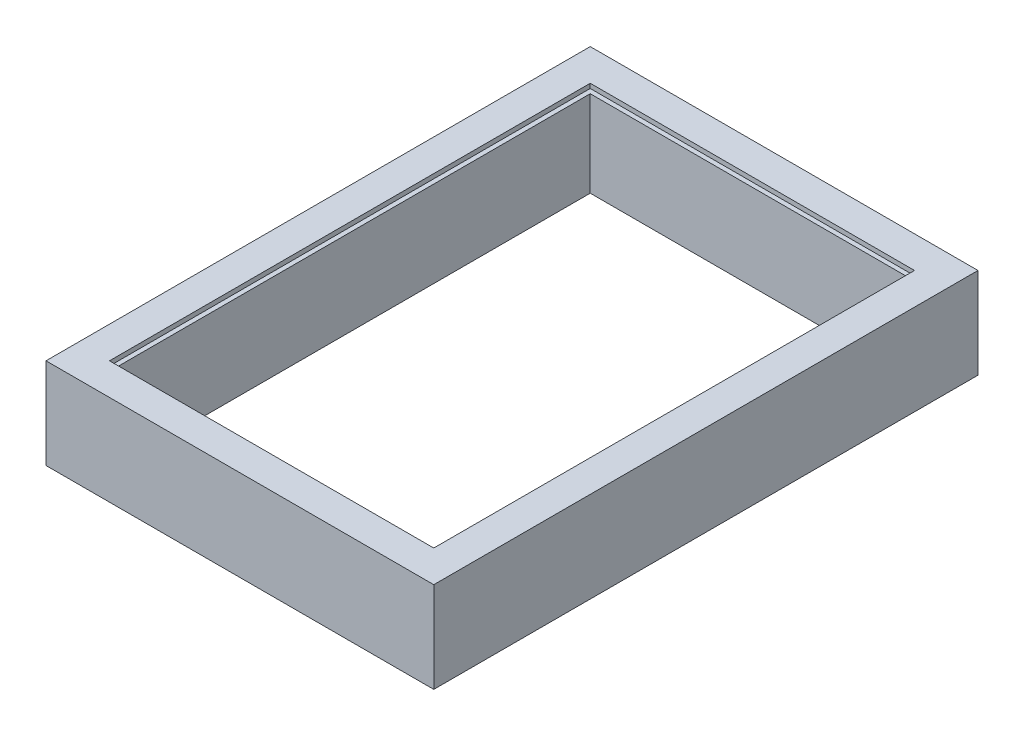
ISO-10303-21;
HEADER;
FILE_DESCRIPTION(('STEP AP214'),'2;1');
FILE_NAME('part.step','',(''),(''),'','','');
FILE_SCHEMA(('AUTOMOTIVE_DESIGN { 1 0 10303 214 1 1 1 1 }'));
ENDSEC;
DATA;
#1=APPLICATION_CONTEXT('core data for automotive mechanical design processes');
#2=APPLICATION_PROTOCOL_DEFINITION('international standard','automotive_design',2000,#1);
#3=PRODUCT_CONTEXT('',#1,'mechanical');
#4=PRODUCT('Part','Part','',(#3));
#5=PRODUCT_RELATED_PRODUCT_CATEGORY('part','',(#4));
#6=PRODUCT_DEFINITION_FORMATION('','',#4);
#7=PRODUCT_DEFINITION_CONTEXT('part definition',#1,'design');
#8=PRODUCT_DEFINITION('design','',#6,#7);
#9=PRODUCT_DEFINITION_SHAPE('','',#8);
#10=(LENGTH_UNIT() NAMED_UNIT(*) SI_UNIT(.MILLI.,.METRE.));
#11=(NAMED_UNIT(*) PLANE_ANGLE_UNIT() SI_UNIT($,.RADIAN.));
#12=(NAMED_UNIT(*) SI_UNIT($,.STERADIAN.) SOLID_ANGLE_UNIT());
#13=UNCERTAINTY_MEASURE_WITH_UNIT(LENGTH_MEASURE(1.E-05),#10,'distance_accuracy_value','');
#14=(GEOMETRIC_REPRESENTATION_CONTEXT(3) GLOBAL_UNCERTAINTY_ASSIGNED_CONTEXT((#13)) GLOBAL_UNIT_ASSIGNED_CONTEXT((#10,
#11,#12)) REPRESENTATION_CONTEXT('',''));
#15=CARTESIAN_POINT('',(0.,0.,0.));
#16=DIRECTION('',(0.,0.,1.));
#17=DIRECTION('',(1.,0.,0.));
#18=AXIS2_PLACEMENT_3D('',#15,#16,#17);
#19=CARTESIAN_POINT('',(347.5,200.,-520.));
#20=DIRECTION('',(-1.,0.,0.));
#21=DIRECTION('',(0.,0.,1.));
#22=AXIS2_PLACEMENT_3D('',#19,#20,#21);
#23=PLANE('',#22);
#24=DIRECTION('',(0.,-1.,0.));
#25=VECTOR('',#24,1.);
#26=CARTESIAN_POINT('',(347.5,200.,520.));
#27=LINE('',#26,#25);
#28=CARTESIAN_POINT('',(347.5,190.,520.));
#29=VERTEX_POINT('',#28);
#30=CARTESIAN_POINT('',(347.5,0.,520.));
#31=VERTEX_POINT('',#30);
#32=EDGE_CURVE('E208',#29,#31,#27,.T.);
#33=ORIENTED_EDGE('',*,*,#32,.F.);
#34=DIRECTION('',(0.,0.,-1.));
#35=VECTOR('',#34,1.);
#36=CARTESIAN_POINT('',(347.5,190.,-520.));
#37=LINE('',#36,#35);
#38=CARTESIAN_POINT('',(347.5,190.,-520.));
#39=VERTEX_POINT('',#38);
#40=EDGE_CURVE('E86',#29,#39,#37,.T.);
#41=ORIENTED_EDGE('',*,*,#40,.T.);
#42=DIRECTION('',(0.,-1.,0.));
#43=VECTOR('',#42,1.);
#44=CARTESIAN_POINT('',(347.5,200.,-520.));
#45=LINE('',#44,#43);
#46=CARTESIAN_POINT('',(347.5,0.,-520.));
#47=VERTEX_POINT('',#46);
#48=EDGE_CURVE('E214',#39,#47,#45,.T.);
#49=ORIENTED_EDGE('',*,*,#48,.T.);
#50=DIRECTION('',(0.,0.,-1.));
#51=VECTOR('',#50,1.);
#52=CARTESIAN_POINT('',(347.5,0.,-520.));
#53=LINE('',#52,#51);
#54=EDGE_CURVE('E196',#31,#47,#53,.T.);
#55=ORIENTED_EDGE('',*,*,#54,.F.);
#56=EDGE_LOOP('',(#33,#41,#49,#55));
#57=FACE_BOUND('',#56,.T.);
#58=ADVANCED_FACE('F63',(#57),#23,.T.);
#59=CARTESIAN_POINT('',(-347.5,200.,-520.));
#60=DIRECTION('',(0.,0.,1.));
#61=DIRECTION('',(1.,0.,0.));
#62=AXIS2_PLACEMENT_3D('',#59,#60,#61);
#63=PLANE('',#62);
#64=ORIENTED_EDGE('',*,*,#48,.F.);
#65=DIRECTION('',(-1.,0.,0.));
#66=VECTOR('',#65,1.);
#67=CARTESIAN_POINT('',(-347.5,190.,-520.));
#68=LINE('',#67,#66);
#69=CARTESIAN_POINT('',(-347.5,190.,-520.));
#70=VERTEX_POINT('',#69);
#71=EDGE_CURVE('E192',#39,#70,#68,.T.);
#72=ORIENTED_EDGE('',*,*,#71,.T.);
#73=DIRECTION('',(0.,-1.,0.));
#74=VECTOR('',#73,1.);
#75=CARTESIAN_POINT('',(-347.5,200.,-520.));
#76=LINE('',#75,#74);
#77=CARTESIAN_POINT('',(-347.5,0.,-520.));
#78=VERTEX_POINT('',#77);
#79=EDGE_CURVE('E212',#70,#78,#76,.T.);
#80=ORIENTED_EDGE('',*,*,#79,.T.);
#81=DIRECTION('',(-1.,0.,0.));
#82=VECTOR('',#81,1.);
#83=CARTESIAN_POINT('',(-347.5,0.,-520.));
#84=LINE('',#83,#82);
#85=EDGE_CURVE('E199',#47,#78,#84,.T.);
#86=ORIENTED_EDGE('',*,*,#85,.F.);
#87=EDGE_LOOP('',(#64,#72,#80,#86));
#88=FACE_BOUND('',#87,.T.);
#89=ADVANCED_FACE('F279',(#88),#63,.T.);
#90=CARTESIAN_POINT('',(-347.5,200.,-520.));
#91=DIRECTION('',(1.,0.,0.));
#92=DIRECTION('',(0.,0.,-1.));
#93=AXIS2_PLACEMENT_3D('',#90,#91,#92);
#94=PLANE('',#93);
#95=ORIENTED_EDGE('',*,*,#79,.F.);
#96=DIRECTION('',(0.,0.,1.));
#97=VECTOR('',#96,1.);
#98=CARTESIAN_POINT('',(-347.5,190.,-520.));
#99=LINE('',#98,#97);
#100=CARTESIAN_POINT('',(-347.5,190.,520.));
#101=VERTEX_POINT('',#100);
#102=EDGE_CURVE('E186',#70,#101,#99,.T.);
#103=ORIENTED_EDGE('',*,*,#102,.T.);
#104=DIRECTION('',(0.,-1.,0.));
#105=VECTOR('',#104,1.);
#106=CARTESIAN_POINT('',(-347.5,200.,520.));
#107=LINE('',#106,#105);
#108=CARTESIAN_POINT('',(-347.5,0.,520.));
#109=VERTEX_POINT('',#108);
#110=EDGE_CURVE('E210',#101,#109,#107,.T.);
#111=ORIENTED_EDGE('',*,*,#110,.T.);
#112=DIRECTION('',(0.,0.,1.));
#113=VECTOR('',#112,1.);
#114=CARTESIAN_POINT('',(-347.5,0.,-520.));
#115=LINE('',#114,#113);
#116=EDGE_CURVE('E202',#78,#109,#115,.T.);
#117=ORIENTED_EDGE('',*,*,#116,.F.);
#118=EDGE_LOOP('',(#95,#103,#111,#117));
#119=FACE_BOUND('',#118,.T.);
#120=ADVANCED_FACE('F274',(#119),#94,.T.);
#121=CARTESIAN_POINT('',(-347.5,200.,520.));
#122=DIRECTION('',(0.,0.,-1.));
#123=DIRECTION('',(-1.,0.,0.));
#124=AXIS2_PLACEMENT_3D('',#121,#122,#123);
#125=PLANE('',#124);
#126=ORIENTED_EDGE('',*,*,#110,.F.);
#127=DIRECTION('',(1.,0.,0.));
#128=VECTOR('',#127,1.);
#129=CARTESIAN_POINT('',(-347.5,190.,520.));
#130=LINE('',#129,#128);
#131=EDGE_CURVE('E12',#101,#29,#130,.T.);
#132=ORIENTED_EDGE('',*,*,#131,.T.);
#133=ORIENTED_EDGE('',*,*,#32,.T.);
#134=DIRECTION('',(1.,0.,0.));
#135=VECTOR('',#134,1.);
#136=CARTESIAN_POINT('',(-347.5,0.,520.));
#137=LINE('',#136,#135);
#138=EDGE_CURVE('E205',#109,#31,#137,.T.);
#139=ORIENTED_EDGE('',*,*,#138,.F.);
#140=EDGE_LOOP('',(#126,#132,#133,#139));
#141=FACE_BOUND('',#140,.T.);
#142=ADVANCED_FACE('F266',(#141),#125,.T.);
#143=CARTESIAN_POINT('',(0.,200.,0.));
#144=DIRECTION('',(0.,1.,0.));
#145=DIRECTION('',(0.,0.,1.));
#146=AXIS2_PLACEMENT_3D('',#143,#144,#145);
#147=PLANE('',#146);
#148=DIRECTION('',(0.,0.,1.));
#149=VECTOR('',#148,1.);
#150=CARTESIAN_POINT('',(-357.5,200.,-530.));
#151=LINE('',#150,#149);
#152=CARTESIAN_POINT('',(-357.5,200.,-530.));
#153=VERTEX_POINT('',#152);
#154=CARTESIAN_POINT('',(-357.5,200.,530.));
#155=VERTEX_POINT('',#154);
#156=EDGE_CURVE('E78',#153,#155,#151,.T.);
#157=ORIENTED_EDGE('',*,*,#156,.F.);
#158=DIRECTION('',(-1.,0.,0.));
#159=VECTOR('',#158,1.);
#160=CARTESIAN_POINT('',(-357.5,200.,-530.));
#161=LINE('',#160,#159);
#162=CARTESIAN_POINT('',(357.5,200.,-530.));
#163=VERTEX_POINT('',#162);
#164=EDGE_CURVE('E171',#163,#153,#161,.T.);
#165=ORIENTED_EDGE('',*,*,#164,.F.);
#166=DIRECTION('',(0.,0.,-1.));
#167=VECTOR('',#166,1.);
#168=CARTESIAN_POINT('',(357.5,200.,-530.));
#169=LINE('',#168,#167);
#170=CARTESIAN_POINT('',(357.5,200.,530.));
#171=VERTEX_POINT('',#170);
#172=EDGE_CURVE('E174',#171,#163,#169,.T.);
#173=ORIENTED_EDGE('',*,*,#172,.F.);
#174=DIRECTION('',(1.,0.,0.));
#175=VECTOR('',#174,1.);
#176=CARTESIAN_POINT('',(-357.5,200.,530.));
#177=LINE('',#176,#175);
#178=EDGE_CURVE('E180',#155,#171,#177,.T.);
#179=ORIENTED_EDGE('',*,*,#178,.F.);
#180=EDGE_LOOP('',(#157,#165,#173,#179));
#181=FACE_BOUND('',#180,.T.);
#182=DIRECTION('',(0.,0.,-1.));
#183=VECTOR('',#182,1.);
#184=CARTESIAN_POINT('',(427.5,200.,-520.));
#185=LINE('',#184,#183);
#186=CARTESIAN_POINT('',(427.5,200.,600.));
#187=VERTEX_POINT('',#186);
#188=CARTESIAN_POINT('',(427.5,200.,-600.));
#189=VERTEX_POINT('',#188);
#190=EDGE_CURVE('E217',#187,#189,#185,.T.);
#191=ORIENTED_EDGE('',*,*,#190,.T.);
#192=DIRECTION('',(-1.,0.,0.));
#193=VECTOR('',#192,1.);
#194=CARTESIAN_POINT('',(-347.5,200.,-600.));
#195=LINE('',#194,#193);
#196=CARTESIAN_POINT('',(-427.5,200.,-600.));
#197=VERTEX_POINT('',#196);
#198=EDGE_CURVE('E220',#189,#197,#195,.T.);
#199=ORIENTED_EDGE('',*,*,#198,.T.);
#200=DIRECTION('',(0.,0.,1.));
#201=VECTOR('',#200,1.);
#202=CARTESIAN_POINT('',(-427.5,200.,-520.));
#203=LINE('',#202,#201);
#204=CARTESIAN_POINT('',(-427.5,200.,600.));
#205=VERTEX_POINT('',#204);
#206=EDGE_CURVE('E223',#197,#205,#203,.T.);
#207=ORIENTED_EDGE('',*,*,#206,.T.);
#208=DIRECTION('',(1.,0.,0.));
#209=VECTOR('',#208,1.);
#210=CARTESIAN_POINT('',(-347.5,200.,600.));
#211=LINE('',#210,#209);
#212=EDGE_CURVE('E225',#205,#187,#211,.T.);
#213=ORIENTED_EDGE('',*,*,#212,.T.);
#214=EDGE_LOOP('',(#191,#199,#207,#213));
#215=FACE_BOUND('',#214,.T.);
#216=ADVANCED_FACE('F264',(#181,#215),#147,.T.);
#217=CARTESIAN_POINT('',(0.,0.,0.));
#218=DIRECTION('',(0.,1.,0.));
#219=DIRECTION('',(0.,0.,1.));
#220=AXIS2_PLACEMENT_3D('',#217,#218,#219);
#221=PLANE('',#220);
#222=DIRECTION('',(0.,0.,-1.));
#223=VECTOR('',#222,1.);
#224=CARTESIAN_POINT('',(427.5,0.,-520.));
#225=LINE('',#224,#223);
#226=CARTESIAN_POINT('',(427.5,0.,600.));
#227=VERTEX_POINT('',#226);
#228=CARTESIAN_POINT('',(427.5,0.,-600.));
#229=VERTEX_POINT('',#228);
#230=EDGE_CURVE('E216',#227,#229,#225,.T.);
#231=ORIENTED_EDGE('',*,*,#230,.F.);
#232=DIRECTION('',(1.,0.,0.));
#233=VECTOR('',#232,1.);
#234=CARTESIAN_POINT('',(-347.5,0.,600.));
#235=LINE('',#234,#233);
#236=CARTESIAN_POINT('',(-427.5,0.,600.));
#237=VERTEX_POINT('',#236);
#238=EDGE_CURVE('E221',#237,#227,#235,.T.);
#239=ORIENTED_EDGE('',*,*,#238,.F.);
#240=DIRECTION('',(0.,0.,1.));
#241=VECTOR('',#240,1.);
#242=CARTESIAN_POINT('',(-427.5,0.,-520.));
#243=LINE('',#242,#241);
#244=CARTESIAN_POINT('',(-427.5,0.,-600.));
#245=VERTEX_POINT('',#244);
#246=EDGE_CURVE('E232',#245,#237,#243,.T.);
#247=ORIENTED_EDGE('',*,*,#246,.F.);
#248=DIRECTION('',(-1.,0.,0.));
#249=VECTOR('',#248,1.);
#250=CARTESIAN_POINT('',(-347.5,0.,-600.));
#251=LINE('',#250,#249);
#252=EDGE_CURVE('E230',#229,#245,#251,.T.);
#253=ORIENTED_EDGE('',*,*,#252,.F.);
#254=EDGE_LOOP('',(#231,#239,#247,#253));
#255=FACE_BOUND('',#254,.T.);
#256=ORIENTED_EDGE('',*,*,#54,.T.);
#257=ORIENTED_EDGE('',*,*,#85,.T.);
#258=ORIENTED_EDGE('',*,*,#116,.T.);
#259=ORIENTED_EDGE('',*,*,#138,.T.);
#260=EDGE_LOOP('',(#256,#257,#258,#259));
#261=FACE_BOUND('',#260,.T.);
#262=ADVANCED_FACE('F253',(#255,#261),#221,.F.);
#263=CARTESIAN_POINT('',(427.5,200.,-520.));
#264=DIRECTION('',(-1.,0.,0.));
#265=DIRECTION('',(0.,0.,1.));
#266=AXIS2_PLACEMENT_3D('',#263,#264,#265);
#267=PLANE('',#266);
#268=ORIENTED_EDGE('',*,*,#230,.T.);
#269=DIRECTION('',(0.,-1.,0.));
#270=VECTOR('',#269,1.);
#271=CARTESIAN_POINT('',(427.5,200.,-600.));
#272=LINE('',#271,#270);
#273=EDGE_CURVE('E71',#189,#229,#272,.T.);
#274=ORIENTED_EDGE('',*,*,#273,.F.);
#275=ORIENTED_EDGE('',*,*,#190,.F.);
#276=DIRECTION('',(0.,-1.,0.));
#277=VECTOR('',#276,1.);
#278=CARTESIAN_POINT('',(427.5,200.,600.));
#279=LINE('',#278,#277);
#280=EDGE_CURVE('E227',#187,#227,#279,.T.);
#281=ORIENTED_EDGE('',*,*,#280,.T.);
#282=EDGE_LOOP('',(#268,#274,#275,#281));
#283=FACE_BOUND('',#282,.T.);
#284=ADVANCED_FACE('F65',(#283),#267,.F.);
#285=CARTESIAN_POINT('',(-347.5,200.,-600.));
#286=DIRECTION('',(0.,0.,1.));
#287=DIRECTION('',(1.,0.,0.));
#288=AXIS2_PLACEMENT_3D('',#285,#286,#287);
#289=PLANE('',#288);
#290=ORIENTED_EDGE('',*,*,#252,.T.);
#291=DIRECTION('',(0.,-1.,0.));
#292=VECTOR('',#291,1.);
#293=CARTESIAN_POINT('',(-427.5,200.,-600.));
#294=LINE('',#293,#292);
#295=EDGE_CURVE('E240',#197,#245,#294,.T.);
#296=ORIENTED_EDGE('',*,*,#295,.F.);
#297=ORIENTED_EDGE('',*,*,#198,.F.);
#298=ORIENTED_EDGE('',*,*,#273,.T.);
#299=EDGE_LOOP('',(#290,#296,#297,#298));
#300=FACE_BOUND('',#299,.T.);
#301=ADVANCED_FACE('F245',(#300),#289,.F.);
#302=CARTESIAN_POINT('',(-427.5,200.,-520.));
#303=DIRECTION('',(1.,0.,0.));
#304=DIRECTION('',(0.,0.,-1.));
#305=AXIS2_PLACEMENT_3D('',#302,#303,#304);
#306=PLANE('',#305);
#307=ORIENTED_EDGE('',*,*,#246,.T.);
#308=DIRECTION('',(0.,-1.,0.));
#309=VECTOR('',#308,1.);
#310=CARTESIAN_POINT('',(-427.5,200.,600.));
#311=LINE('',#310,#309);
#312=EDGE_CURVE('E237',#205,#237,#311,.T.);
#313=ORIENTED_EDGE('',*,*,#312,.F.);
#314=ORIENTED_EDGE('',*,*,#206,.F.);
#315=ORIENTED_EDGE('',*,*,#295,.T.);
#316=EDGE_LOOP('',(#307,#313,#314,#315));
#317=FACE_BOUND('',#316,.T.);
#318=ADVANCED_FACE('F258',(#317),#306,.F.);
#319=CARTESIAN_POINT('',(-347.5,200.,600.));
#320=DIRECTION('',(0.,0.,-1.));
#321=DIRECTION('',(-1.,0.,0.));
#322=AXIS2_PLACEMENT_3D('',#319,#320,#321);
#323=PLANE('',#322);
#324=ORIENTED_EDGE('',*,*,#238,.T.);
#325=ORIENTED_EDGE('',*,*,#280,.F.);
#326=ORIENTED_EDGE('',*,*,#212,.F.);
#327=ORIENTED_EDGE('',*,*,#312,.T.);
#328=EDGE_LOOP('',(#324,#325,#326,#327));
#329=FACE_BOUND('',#328,.T.);
#330=ADVANCED_FACE('F262',(#329),#323,.F.);
#331=CARTESIAN_POINT('',(-357.5,190.,-530.));
#332=DIRECTION('',(-1.,0.,0.));
#333=DIRECTION('',(0.,0.,1.));
#334=AXIS2_PLACEMENT_3D('',#331,#332,#333);
#335=PLANE('',#334);
#336=ORIENTED_EDGE('',*,*,#156,.T.);
#337=DIRECTION('',(0.,1.,0.));
#338=VECTOR('',#337,1.);
#339=CARTESIAN_POINT('',(-357.5,190.,530.));
#340=LINE('',#339,#338);
#341=CARTESIAN_POINT('',(-357.5,190.,530.));
#342=VERTEX_POINT('',#341);
#343=EDGE_CURVE('E149',#342,#155,#340,.T.);
#344=ORIENTED_EDGE('',*,*,#343,.F.);
#345=DIRECTION('',(0.,0.,1.));
#346=VECTOR('',#345,1.);
#347=CARTESIAN_POINT('',(-357.5,190.,-530.));
#348=LINE('',#347,#346);
#349=CARTESIAN_POINT('',(-357.5,190.,-530.));
#350=VERTEX_POINT('',#349);
#351=EDGE_CURVE('E153',#350,#342,#348,.T.);
#352=ORIENTED_EDGE('',*,*,#351,.F.);
#353=DIRECTION('',(0.,1.,0.));
#354=VECTOR('',#353,1.);
#355=CARTESIAN_POINT('',(-357.5,190.,-530.));
#356=LINE('',#355,#354);
#357=EDGE_CURVE('E184',#350,#153,#356,.T.);
#358=ORIENTED_EDGE('',*,*,#357,.T.);
#359=EDGE_LOOP('',(#336,#344,#352,#358));
#360=FACE_BOUND('',#359,.T.);
#361=ADVANCED_FACE('F151',(#360),#335,.F.);
#362=CARTESIAN_POINT('',(-357.5,190.,-530.));
#363=DIRECTION('',(0.,0.,-1.));
#364=DIRECTION('',(-1.,0.,0.));
#365=AXIS2_PLACEMENT_3D('',#362,#363,#364);
#366=PLANE('',#365);
#367=ORIENTED_EDGE('',*,*,#164,.T.);
#368=ORIENTED_EDGE('',*,*,#357,.F.);
#369=DIRECTION('',(-1.,0.,0.));
#370=VECTOR('',#369,1.);
#371=CARTESIAN_POINT('',(-357.5,190.,-530.));
#372=LINE('',#371,#370);
#373=CARTESIAN_POINT('',(357.5,190.,-530.));
#374=VERTEX_POINT('',#373);
#375=EDGE_CURVE('E159',#374,#350,#372,.T.);
#376=ORIENTED_EDGE('',*,*,#375,.F.);
#377=DIRECTION('',(0.,1.,0.));
#378=VECTOR('',#377,1.);
#379=CARTESIAN_POINT('',(357.5,190.,-530.));
#380=LINE('',#379,#378);
#381=EDGE_CURVE('E187',#374,#163,#380,.T.);
#382=ORIENTED_EDGE('',*,*,#381,.T.);
#383=EDGE_LOOP('',(#367,#368,#376,#382));
#384=FACE_BOUND('',#383,.T.);
#385=ADVANCED_FACE('F293',(#384),#366,.F.);
#386=CARTESIAN_POINT('',(357.5,190.,-530.));
#387=DIRECTION('',(1.,0.,0.));
#388=DIRECTION('',(0.,0.,-1.));
#389=AXIS2_PLACEMENT_3D('',#386,#387,#388);
#390=PLANE('',#389);
#391=ORIENTED_EDGE('',*,*,#172,.T.);
#392=ORIENTED_EDGE('',*,*,#381,.F.);
#393=DIRECTION('',(0.,0.,-1.));
#394=VECTOR('',#393,1.);
#395=CARTESIAN_POINT('',(357.5,190.,-530.));
#396=LINE('',#395,#394);
#397=CARTESIAN_POINT('',(357.5,190.,530.));
#398=VERTEX_POINT('',#397);
#399=EDGE_CURVE('E167',#398,#374,#396,.T.);
#400=ORIENTED_EDGE('',*,*,#399,.F.);
#401=DIRECTION('',(0.,1.,0.));
#402=VECTOR('',#401,1.);
#403=CARTESIAN_POINT('',(357.5,190.,530.));
#404=LINE('',#403,#402);
#405=EDGE_CURVE('E158',#398,#171,#404,.T.);
#406=ORIENTED_EDGE('',*,*,#405,.T.);
#407=EDGE_LOOP('',(#391,#392,#400,#406));
#408=FACE_BOUND('',#407,.T.);
#409=ADVANCED_FACE('F296',(#408),#390,.F.);
#410=CARTESIAN_POINT('',(-357.5,190.,530.));
#411=DIRECTION('',(0.,0.,1.));
#412=DIRECTION('',(1.,0.,0.));
#413=AXIS2_PLACEMENT_3D('',#410,#411,#412);
#414=PLANE('',#413);
#415=ORIENTED_EDGE('',*,*,#178,.T.);
#416=ORIENTED_EDGE('',*,*,#405,.F.);
#417=DIRECTION('',(1.,0.,0.));
#418=VECTOR('',#417,1.);
#419=CARTESIAN_POINT('',(-357.5,190.,530.));
#420=LINE('',#419,#418);
#421=EDGE_CURVE('E162',#342,#398,#420,.T.);
#422=ORIENTED_EDGE('',*,*,#421,.F.);
#423=ORIENTED_EDGE('',*,*,#343,.T.);
#424=EDGE_LOOP('',(#415,#416,#422,#423));
#425=FACE_BOUND('',#424,.T.);
#426=ADVANCED_FACE('F163',(#425),#414,.F.);
#427=CARTESIAN_POINT('',(0.,190.,0.));
#428=DIRECTION('',(0.,1.,0.));
#429=DIRECTION('',(0.,0.,1.));
#430=AXIS2_PLACEMENT_3D('',#427,#428,#429);
#431=PLANE('',#430);
#432=ORIENTED_EDGE('',*,*,#131,.F.);
#433=ORIENTED_EDGE('',*,*,#102,.F.);
#434=ORIENTED_EDGE('',*,*,#71,.F.);
#435=ORIENTED_EDGE('',*,*,#40,.F.);
#436=EDGE_LOOP('',(#432,#433,#434,#435));
#437=FACE_BOUND('',#436,.T.);
#438=ORIENTED_EDGE('',*,*,#351,.T.);
#439=ORIENTED_EDGE('',*,*,#421,.T.);
#440=ORIENTED_EDGE('',*,*,#399,.T.);
#441=ORIENTED_EDGE('',*,*,#375,.T.);
#442=EDGE_LOOP('',(#438,#439,#440,#441));
#443=FACE_BOUND('',#442,.T.);
#444=ADVANCED_FACE('F169',(#437,#443),#431,.T.);
#445=CLOSED_SHELL('',(#58,#89,#120,#142,#216,#262,#284,#301,#318,#330,#361,#385,#409,#426,#444));
#446=MANIFOLD_SOLID_BREP('B2',#445);
#447=ADVANCED_BREP_SHAPE_REPRESENTATION('',(#18,#446),#14);
#448=SHAPE_DEFINITION_REPRESENTATION(#9,#447);
ENDSEC;
END-ISO-10303-21;
